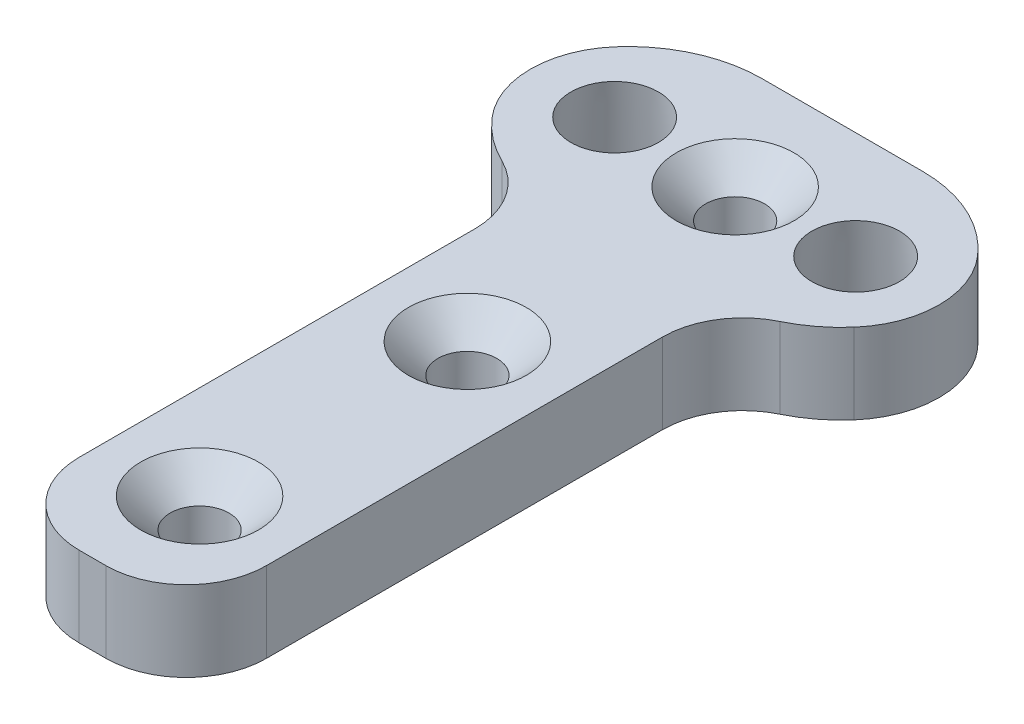
ISO-10303-21;
HEADER;
FILE_DESCRIPTION(('STEP AP214'),'2;1');
FILE_NAME('part.step','',(''),(''),'','','');
FILE_SCHEMA(('AUTOMOTIVE_DESIGN { 1 0 10303 214 1 1 1 1 }'));
ENDSEC;
DATA;
#1=APPLICATION_CONTEXT('core data for automotive mechanical design processes');
#2=APPLICATION_PROTOCOL_DEFINITION('international standard','automotive_design',2000,#1);
#3=PRODUCT_CONTEXT('',#1,'mechanical');
#4=PRODUCT('Part','Part','',(#3));
#5=PRODUCT_RELATED_PRODUCT_CATEGORY('part','',(#4));
#6=PRODUCT_DEFINITION_FORMATION('','',#4);
#7=PRODUCT_DEFINITION_CONTEXT('part definition',#1,'design');
#8=PRODUCT_DEFINITION('design','',#6,#7);
#9=PRODUCT_DEFINITION_SHAPE('','',#8);
#10=(LENGTH_UNIT() NAMED_UNIT(*) SI_UNIT(.MILLI.,.METRE.));
#11=(NAMED_UNIT(*) PLANE_ANGLE_UNIT() SI_UNIT($,.RADIAN.));
#12=(NAMED_UNIT(*) SI_UNIT($,.STERADIAN.) SOLID_ANGLE_UNIT());
#13=UNCERTAINTY_MEASURE_WITH_UNIT(LENGTH_MEASURE(1.E-05),#10,'distance_accuracy_value','');
#14=(GEOMETRIC_REPRESENTATION_CONTEXT(3) GLOBAL_UNCERTAINTY_ASSIGNED_CONTEXT((#13)) GLOBAL_UNIT_ASSIGNED_CONTEXT((#10,
#11,#12)) REPRESENTATION_CONTEXT('',''));
#15=CARTESIAN_POINT('',(0.,0.,0.));
#16=DIRECTION('',(0.,0.,1.));
#17=DIRECTION('',(1.,0.,0.));
#18=AXIS2_PLACEMENT_3D('',#15,#16,#17);
#19=CARTESIAN_POINT('',(0.,3.,0.));
#20=DIRECTION('',(0.,-1.,0.));
#21=DIRECTION('',(0.,0.,-1.));
#22=AXIS2_PLACEMENT_3D('',#19,#20,#21);
#23=PLANE('',#22);
#24=CARTESIAN_POINT('',(-4.5,3.,-10.));
#25=DIRECTION('',(0.,-1.,0.));
#26=DIRECTION('',(0.,0.,-1.));
#27=AXIS2_PLACEMENT_3D('',#24,#25,#26);
#28=CIRCLE('',#27,1.63613285540738);
#29=CARTESIAN_POINT('',(-4.5,3.,-11.6361328554074));
#30=VERTEX_POINT('',#29);
#31=EDGE_CURVE('E445',#30,#30,#28,.T.);
#32=ORIENTED_EDGE('',*,*,#31,.T.);
#33=EDGE_LOOP('',(#32));
#34=FACE_BOUND('',#33,.T.);
#35=CARTESIAN_POINT('',(4.5,3.,-10.));
#36=DIRECTION('',(0.,-1.,0.));
#37=DIRECTION('',(0.,0.,-1.));
#38=AXIS2_PLACEMENT_3D('',#35,#36,#37);
#39=CIRCLE('',#38,1.63613285540738);
#40=CARTESIAN_POINT('',(4.5,3.,-11.6361328554074));
#41=VERTEX_POINT('',#40);
#42=EDGE_CURVE('E37',#41,#41,#39,.T.);
#43=ORIENTED_EDGE('',*,*,#42,.T.);
#44=EDGE_LOOP('',(#43));
#45=FACE_BOUND('',#44,.T.);
#46=CARTESIAN_POINT('',(0.,3.,-10.));
#47=DIRECTION('',(0.,1.,0.));
#48=DIRECTION('',(0.,0.,1.));
#49=AXIS2_PLACEMENT_3D('',#46,#47,#48);
#50=CIRCLE('',#49,2.2);
#51=CARTESIAN_POINT('',(0.,3.,-7.8));
#52=VERTEX_POINT('',#51);
#53=EDGE_CURVE('E439',#52,#52,#50,.T.);
#54=ORIENTED_EDGE('',*,*,#53,.F.);
#55=EDGE_LOOP('',(#54));
#56=FACE_BOUND('',#55,.T.);
#57=CARTESIAN_POINT('',(0.,3.,0.));
#58=DIRECTION('',(0.,1.,0.));
#59=DIRECTION('',(0.,0.,1.));
#60=AXIS2_PLACEMENT_3D('',#57,#58,#59);
#61=CIRCLE('',#60,2.2);
#62=CARTESIAN_POINT('',(0.,3.,2.2));
#63=VERTEX_POINT('',#62);
#64=EDGE_CURVE('E430',#63,#63,#61,.T.);
#65=ORIENTED_EDGE('',*,*,#64,.F.);
#66=EDGE_LOOP('',(#65));
#67=FACE_BOUND('',#66,.T.);
#68=CARTESIAN_POINT('',(0.,3.,10.));
#69=DIRECTION('',(0.,1.,0.));
#70=DIRECTION('',(0.,0.,1.));
#71=AXIS2_PLACEMENT_3D('',#68,#69,#70);
#72=CIRCLE('',#71,2.2);
#73=CARTESIAN_POINT('',(0.,3.,12.2));
#74=VERTEX_POINT('',#73);
#75=EDGE_CURVE('E420',#74,#74,#72,.T.);
#76=ORIENTED_EDGE('',*,*,#75,.F.);
#77=EDGE_LOOP('',(#76));
#78=FACE_BOUND('',#77,.T.);
#79=DIRECTION('',(0.,0.,1.));
#80=VECTOR('',#79,1.);
#81=CARTESIAN_POINT('',(-3.5,3.,-6.));
#82=LINE('',#81,#80);
#83=CARTESIAN_POINT('',(-3.5,3.,-3.78118990056402));
#84=VERTEX_POINT('',#83);
#85=CARTESIAN_POINT('',(-3.5,3.,11.));
#86=VERTEX_POINT('',#85);
#87=EDGE_CURVE('E158',#84,#86,#82,.T.);
#88=ORIENTED_EDGE('',*,*,#87,.T.);
#89=CARTESIAN_POINT('',(-0.499999999999997,3.,11.));
#90=DIRECTION('',(0.,-1.,0.));
#91=DIRECTION('',(0.,0.,-1.));
#92=AXIS2_PLACEMENT_3D('',#89,#90,#91);
#93=CIRCLE('',#92,3.);
#94=CARTESIAN_POINT('',(-0.499999999999997,3.,14.));
#95=VERTEX_POINT('',#94);
#96=EDGE_CURVE('E56',#86,#95,#93,.F.);
#97=ORIENTED_EDGE('',*,*,#96,.T.);
#98=DIRECTION('',(1.,0.,0.));
#99=VECTOR('',#98,1.);
#100=CARTESIAN_POINT('',(-3.5,3.,14.));
#101=LINE('',#100,#99);
#102=CARTESIAN_POINT('',(0.500000000000003,3.,14.));
#103=VERTEX_POINT('',#102);
#104=EDGE_CURVE('E277',#95,#103,#101,.T.);
#105=ORIENTED_EDGE('',*,*,#104,.T.);
#106=CARTESIAN_POINT('',(0.500000000000003,3.,11.));
#107=DIRECTION('',(0.,-1.,0.));
#108=DIRECTION('',(0.,0.,-1.));
#109=AXIS2_PLACEMENT_3D('',#106,#107,#108);
#110=CIRCLE('',#109,3.);
#111=CARTESIAN_POINT('',(3.5,3.,11.));
#112=VERTEX_POINT('',#111);
#113=EDGE_CURVE('E225',#103,#112,#110,.F.);
#114=ORIENTED_EDGE('',*,*,#113,.T.);
#115=DIRECTION('',(0.,0.,-1.));
#116=VECTOR('',#115,1.);
#117=CARTESIAN_POINT('',(3.5,3.,-6.));
#118=LINE('',#117,#116);
#119=CARTESIAN_POINT('',(3.5,3.,-3.78118990056402));
#120=VERTEX_POINT('',#119);
#121=EDGE_CURVE('E168',#112,#120,#118,.T.);
#122=ORIENTED_EDGE('',*,*,#121,.T.);
#123=CARTESIAN_POINT('',(6.5,3.,-3.78118990056402));
#124=DIRECTION('',(0.,-1.,0.));
#125=DIRECTION('',(0.,0.,-1.));
#126=AXIS2_PLACEMENT_3D('',#123,#124,#125);
#127=CIRCLE('',#126,3.);
#128=CARTESIAN_POINT('',(5.1875,3.,-6.47884513242743));
#129=VERTEX_POINT('',#128);
#130=EDGE_CURVE('E11',#120,#129,#127,.T.);
#131=ORIENTED_EDGE('',*,*,#130,.T.);
#132=CARTESIAN_POINT('',(3.,3.,-10.9749371855331));
#133=DIRECTION('',(0.,-1.,0.));
#134=DIRECTION('',(0.,0.,-1.));
#135=AXIS2_PLACEMENT_3D('',#132,#133,#134);
#136=CIRCLE('',#135,5.);
#137=CARTESIAN_POINT('',(6.76372418740866,3.,-7.6833752096446));
#138=VERTEX_POINT('',#137);
#139=EDGE_CURVE('E177',#129,#138,#136,.F.);
#140=ORIENTED_EDGE('',*,*,#139,.T.);
#141=CARTESIAN_POINT('',(4.1291172562226,3.,-9.98746859276655));
#142=DIRECTION('',(0.,-1.,0.));
#143=DIRECTION('',(0.,0.,-1.));
#144=AXIS2_PLACEMENT_3D('',#141,#142,#143);
#145=CIRCLE('',#144,3.5);
#146=CARTESIAN_POINT('',(6.76372418740865,3.,-12.2915619758885));
#147=VERTEX_POINT('',#146);
#148=EDGE_CURVE('E190',#138,#147,#145,.F.);
#149=ORIENTED_EDGE('',*,*,#148,.T.);
#150=CARTESIAN_POINT('',(3.,3.,-9.));
#151=DIRECTION('',(0.,-1.,0.));
#152=DIRECTION('',(0.,0.,-1.));
#153=AXIS2_PLACEMENT_3D('',#150,#151,#152);
#154=CIRCLE('',#153,5.);
#155=CARTESIAN_POINT('',(3.,3.,-14.));
#156=VERTEX_POINT('',#155);
#157=EDGE_CURVE('E175',#147,#156,#154,.F.);
#158=ORIENTED_EDGE('',*,*,#157,.T.);
#159=DIRECTION('',(-1.,0.,0.));
#160=VECTOR('',#159,1.);
#161=CARTESIAN_POINT('',(-8.,3.,-14.));
#162=LINE('',#161,#160);
#163=CARTESIAN_POINT('',(-3.,3.,-14.));
#164=VERTEX_POINT('',#163);
#165=EDGE_CURVE('E143',#156,#164,#162,.T.);
#166=ORIENTED_EDGE('',*,*,#165,.T.);
#167=CARTESIAN_POINT('',(-3.,3.,-9.));
#168=DIRECTION('',(0.,-1.,0.));
#169=DIRECTION('',(0.,0.,-1.));
#170=AXIS2_PLACEMENT_3D('',#167,#168,#169);
#171=CIRCLE('',#170,5.);
#172=CARTESIAN_POINT('',(-6.76372418740866,3.,-12.2915619758885));
#173=VERTEX_POINT('',#172);
#174=EDGE_CURVE('E179',#164,#173,#171,.F.);
#175=ORIENTED_EDGE('',*,*,#174,.T.);
#176=CARTESIAN_POINT('',(-4.1291172562226,3.,-9.98746859276655));
#177=DIRECTION('',(0.,-1.,0.));
#178=DIRECTION('',(0.,0.,-1.));
#179=AXIS2_PLACEMENT_3D('',#176,#177,#178);
#180=CIRCLE('',#179,3.5);
#181=CARTESIAN_POINT('',(-6.76372418740865,3.,-7.68337520964459));
#182=VERTEX_POINT('',#181);
#183=EDGE_CURVE('E188',#173,#182,#180,.F.);
#184=ORIENTED_EDGE('',*,*,#183,.T.);
#185=CARTESIAN_POINT('',(-3.,3.,-10.9749371855331));
#186=DIRECTION('',(0.,-1.,0.));
#187=DIRECTION('',(0.,0.,-1.));
#188=AXIS2_PLACEMENT_3D('',#185,#186,#187);
#189=CIRCLE('',#188,5.);
#190=CARTESIAN_POINT('',(-5.1875,3.,-6.47884513242743));
#191=VERTEX_POINT('',#190);
#192=EDGE_CURVE('E148',#182,#191,#189,.F.);
#193=ORIENTED_EDGE('',*,*,#192,.T.);
#194=CARTESIAN_POINT('',(-6.5,3.,-3.78118990056402));
#195=DIRECTION('',(0.,-1.,0.));
#196=DIRECTION('',(0.,0.,-1.));
#197=AXIS2_PLACEMENT_3D('',#194,#195,#196);
#198=CIRCLE('',#197,3.);
#199=EDGE_CURVE('E230',#191,#84,#198,.T.);
#200=ORIENTED_EDGE('',*,*,#199,.T.);
#201=EDGE_LOOP('',(#88,#97,#105,#114,#122,#131,#140,#149,#158,#166,#175,#184,#193,#200));
#202=FACE_BOUND('',#201,.T.);
#203=ADVANCED_FACE('F33',(#34,#45,#56,#67,#78,#202),#23,.F.);
#204=CARTESIAN_POINT('',(-3.5,3.,-6.));
#205=DIRECTION('',(1.,0.,0.));
#206=DIRECTION('',(0.,0.,-1.));
#207=AXIS2_PLACEMENT_3D('',#204,#205,#206);
#208=PLANE('',#207);
#209=ORIENTED_EDGE('',*,*,#87,.F.);
#210=DIRECTION('',(0.,-1.,0.));
#211=VECTOR('',#210,1.);
#212=CARTESIAN_POINT('',(-3.5,3.,-3.78118990056402));
#213=LINE('',#212,#211);
#214=CARTESIAN_POINT('',(-3.5,0.,-3.78118990056402));
#215=VERTEX_POINT('',#214);
#216=EDGE_CURVE('E204',#84,#215,#213,.T.);
#217=ORIENTED_EDGE('',*,*,#216,.T.);
#218=DIRECTION('',(0.,0.,1.));
#219=VECTOR('',#218,1.);
#220=CARTESIAN_POINT('',(-3.5,0.,-6.));
#221=LINE('',#220,#219);
#222=CARTESIAN_POINT('',(-3.5,0.,11.));
#223=VERTEX_POINT('',#222);
#224=EDGE_CURVE('E285',#215,#223,#221,.T.);
#225=ORIENTED_EDGE('',*,*,#224,.T.);
#226=DIRECTION('',(0.,-1.,0.));
#227=VECTOR('',#226,1.);
#228=CARTESIAN_POINT('',(-3.5,3.,11.));
#229=LINE('',#228,#227);
#230=EDGE_CURVE('E202',#223,#86,#229,.F.);
#231=ORIENTED_EDGE('',*,*,#230,.T.);
#232=EDGE_LOOP('',(#209,#217,#225,#231));
#233=FACE_BOUND('',#232,.T.);
#234=ADVANCED_FACE('F273',(#233),#208,.F.);
#235=CARTESIAN_POINT('',(-3.5,3.,14.));
#236=DIRECTION('',(0.,0.,-1.));
#237=DIRECTION('',(-1.,0.,0.));
#238=AXIS2_PLACEMENT_3D('',#235,#236,#237);
#239=PLANE('',#238);
#240=ORIENTED_EDGE('',*,*,#104,.F.);
#241=DIRECTION('',(0.,-1.,0.));
#242=VECTOR('',#241,1.);
#243=CARTESIAN_POINT('',(-0.499999999999997,3.,14.));
#244=LINE('',#243,#242);
#245=CARTESIAN_POINT('',(-0.499999999999997,0.,14.));
#246=VERTEX_POINT('',#245);
#247=EDGE_CURVE('E218',#95,#246,#244,.T.);
#248=ORIENTED_EDGE('',*,*,#247,.T.);
#249=DIRECTION('',(1.,0.,0.));
#250=VECTOR('',#249,1.);
#251=CARTESIAN_POINT('',(-3.5,0.,14.));
#252=LINE('',#251,#250);
#253=CARTESIAN_POINT('',(0.500000000000003,0.,14.));
#254=VERTEX_POINT('',#253);
#255=EDGE_CURVE('E243',#246,#254,#252,.T.);
#256=ORIENTED_EDGE('',*,*,#255,.T.);
#257=DIRECTION('',(0.,-1.,0.));
#258=VECTOR('',#257,1.);
#259=CARTESIAN_POINT('',(0.500000000000003,3.,14.));
#260=LINE('',#259,#258);
#261=EDGE_CURVE('E49',#254,#103,#260,.F.);
#262=ORIENTED_EDGE('',*,*,#261,.T.);
#263=EDGE_LOOP('',(#240,#248,#256,#262));
#264=FACE_BOUND('',#263,.T.);
#265=ADVANCED_FACE('F287',(#264),#239,.F.);
#266=CARTESIAN_POINT('',(3.5,3.,-6.));
#267=DIRECTION('',(-1.,0.,0.));
#268=DIRECTION('',(0.,0.,1.));
#269=AXIS2_PLACEMENT_3D('',#266,#267,#268);
#270=PLANE('',#269);
#271=DIRECTION('',(0.,0.,-1.));
#272=VECTOR('',#271,1.);
#273=CARTESIAN_POINT('',(3.5,0.,-6.));
#274=LINE('',#273,#272);
#275=CARTESIAN_POINT('',(3.5,0.,11.));
#276=VERTEX_POINT('',#275);
#277=CARTESIAN_POINT('',(3.5,0.,-3.78118990056402));
#278=VERTEX_POINT('',#277);
#279=EDGE_CURVE('E159',#276,#278,#274,.T.);
#280=ORIENTED_EDGE('',*,*,#279,.T.);
#281=DIRECTION('',(0.,1.,0.));
#282=VECTOR('',#281,1.);
#283=CARTESIAN_POINT('',(3.5,3.,-3.78118990056402));
#284=LINE('',#283,#282);
#285=EDGE_CURVE('E215',#278,#120,#284,.T.);
#286=ORIENTED_EDGE('',*,*,#285,.T.);
#287=ORIENTED_EDGE('',*,*,#121,.F.);
#288=DIRECTION('',(0.,-1.,0.));
#289=VECTOR('',#288,1.);
#290=CARTESIAN_POINT('',(3.5,3.,11.));
#291=LINE('',#290,#289);
#292=EDGE_CURVE('E212',#112,#276,#291,.T.);
#293=ORIENTED_EDGE('',*,*,#292,.T.);
#294=EDGE_LOOP('',(#280,#286,#287,#293));
#295=FACE_BOUND('',#294,.T.);
#296=ADVANCED_FACE('F239',(#295),#270,.F.);
#297=CARTESIAN_POINT('',(-8.,3.,-14.));
#298=DIRECTION('',(0.,0.,1.));
#299=DIRECTION('',(1.,0.,0.));
#300=AXIS2_PLACEMENT_3D('',#297,#298,#299);
#301=PLANE('',#300);
#302=DIRECTION('',(-1.,0.,0.));
#303=VECTOR('',#302,1.);
#304=CARTESIAN_POINT('',(-8.,0.,-14.));
#305=LINE('',#304,#303);
#306=CARTESIAN_POINT('',(3.,0.,-14.));
#307=VERTEX_POINT('',#306);
#308=CARTESIAN_POINT('',(-3.,0.,-14.));
#309=VERTEX_POINT('',#308);
#310=EDGE_CURVE('E140',#307,#309,#305,.T.);
#311=ORIENTED_EDGE('',*,*,#310,.T.);
#312=DIRECTION('',(0.,-1.,0.));
#313=VECTOR('',#312,1.);
#314=CARTESIAN_POINT('',(-3.,3.,-14.));
#315=LINE('',#314,#313);
#316=EDGE_CURVE('E147',#309,#164,#315,.F.);
#317=ORIENTED_EDGE('',*,*,#316,.T.);
#318=ORIENTED_EDGE('',*,*,#165,.F.);
#319=DIRECTION('',(0.,-1.,0.));
#320=VECTOR('',#319,1.);
#321=CARTESIAN_POINT('',(3.,3.,-14.));
#322=LINE('',#321,#320);
#323=EDGE_CURVE('E137',#156,#307,#322,.T.);
#324=ORIENTED_EDGE('',*,*,#323,.T.);
#325=EDGE_LOOP('',(#311,#317,#318,#324));
#326=FACE_BOUND('',#325,.T.);
#327=ADVANCED_FACE('F139',(#326),#301,.F.);
#328=CARTESIAN_POINT('',(0.,0.,0.));
#329=DIRECTION('',(0.,-1.,0.));
#330=DIRECTION('',(0.,0.,-1.));
#331=AXIS2_PLACEMENT_3D('',#328,#329,#330);
#332=PLANE('',#331);
#333=CARTESIAN_POINT('',(-4.5,0.,-10.));
#334=DIRECTION('',(0.,-1.,0.));
#335=DIRECTION('',(0.,0.,-1.));
#336=AXIS2_PLACEMENT_3D('',#333,#334,#335);
#337=CIRCLE('',#336,1.925);
#338=CARTESIAN_POINT('',(-4.5,0.,-11.925));
#339=VERTEX_POINT('',#338);
#340=EDGE_CURVE('E447',#339,#339,#337,.T.);
#341=ORIENTED_EDGE('',*,*,#340,.F.);
#342=EDGE_LOOP('',(#341));
#343=FACE_BOUND('',#342,.T.);
#344=CARTESIAN_POINT('',(4.5,0.,-10.));
#345=DIRECTION('',(0.,-1.,0.));
#346=DIRECTION('',(0.,0.,-1.));
#347=AXIS2_PLACEMENT_3D('',#344,#345,#346);
#348=CIRCLE('',#347,1.925);
#349=CARTESIAN_POINT('',(4.5,0.,-11.925));
#350=VERTEX_POINT('',#349);
#351=EDGE_CURVE('E442',#350,#350,#348,.T.);
#352=ORIENTED_EDGE('',*,*,#351,.F.);
#353=EDGE_LOOP('',(#352));
#354=FACE_BOUND('',#353,.T.);
#355=CARTESIAN_POINT('',(0.,0.,-10.));
#356=DIRECTION('',(0.,1.,0.));
#357=DIRECTION('',(0.,0.,1.));
#358=AXIS2_PLACEMENT_3D('',#355,#356,#357);
#359=CIRCLE('',#358,1.1);
#360=CARTESIAN_POINT('',(0.,0.,-8.9));
#361=VERTEX_POINT('',#360);
#362=EDGE_CURVE('E433',#361,#361,#359,.T.);
#363=ORIENTED_EDGE('',*,*,#362,.T.);
#364=EDGE_LOOP('',(#363));
#365=FACE_BOUND('',#364,.T.);
#366=CARTESIAN_POINT('',(0.,0.,0.));
#367=DIRECTION('',(0.,1.,0.));
#368=DIRECTION('',(0.,0.,1.));
#369=AXIS2_PLACEMENT_3D('',#366,#367,#368);
#370=CIRCLE('',#369,1.1);
#371=CARTESIAN_POINT('',(0.,0.,1.1));
#372=VERTEX_POINT('',#371);
#373=EDGE_CURVE('E422',#372,#372,#370,.T.);
#374=ORIENTED_EDGE('',*,*,#373,.T.);
#375=EDGE_LOOP('',(#374));
#376=FACE_BOUND('',#375,.T.);
#377=CARTESIAN_POINT('',(0.,0.,10.));
#378=DIRECTION('',(0.,1.,0.));
#379=DIRECTION('',(0.,0.,1.));
#380=AXIS2_PLACEMENT_3D('',#377,#378,#379);
#381=CIRCLE('',#380,1.1);
#382=CARTESIAN_POINT('',(0.,0.,11.1));
#383=VERTEX_POINT('',#382);
#384=EDGE_CURVE('E281',#383,#383,#381,.T.);
#385=ORIENTED_EDGE('',*,*,#384,.T.);
#386=EDGE_LOOP('',(#385));
#387=FACE_BOUND('',#386,.T.);
#388=ORIENTED_EDGE('',*,*,#255,.F.);
#389=CARTESIAN_POINT('',(-0.499999999999997,0.,11.));
#390=DIRECTION('',(0.,-1.,0.));
#391=DIRECTION('',(0.,0.,-1.));
#392=AXIS2_PLACEMENT_3D('',#389,#390,#391);
#393=CIRCLE('',#392,3.);
#394=EDGE_CURVE('E223',#246,#223,#393,.T.);
#395=ORIENTED_EDGE('',*,*,#394,.T.);
#396=ORIENTED_EDGE('',*,*,#224,.F.);
#397=CARTESIAN_POINT('',(-6.5,0.,-3.78118990056402));
#398=DIRECTION('',(0.,-1.,0.));
#399=DIRECTION('',(0.,0.,-1.));
#400=AXIS2_PLACEMENT_3D('',#397,#398,#399);
#401=CIRCLE('',#400,3.);
#402=CARTESIAN_POINT('',(-5.1875,0.,-6.47884513242743));
#403=VERTEX_POINT('',#402);
#404=EDGE_CURVE('E228',#215,#403,#401,.F.);
#405=ORIENTED_EDGE('',*,*,#404,.T.);
#406=CARTESIAN_POINT('',(-3.,0.,-10.9749371855331));
#407=DIRECTION('',(0.,-1.,0.));
#408=DIRECTION('',(0.,0.,-1.));
#409=AXIS2_PLACEMENT_3D('',#406,#407,#408);
#410=CIRCLE('',#409,5.);
#411=CARTESIAN_POINT('',(-6.76372418740865,0.,-7.68337520964459));
#412=VERTEX_POINT('',#411);
#413=EDGE_CURVE('E173',#403,#412,#410,.T.);
#414=ORIENTED_EDGE('',*,*,#413,.T.);
#415=CARTESIAN_POINT('',(-4.1291172562226,0.,-9.98746859276655));
#416=DIRECTION('',(0.,-1.,0.));
#417=DIRECTION('',(0.,0.,-1.));
#418=AXIS2_PLACEMENT_3D('',#415,#416,#417);
#419=CIRCLE('',#418,3.5);
#420=CARTESIAN_POINT('',(-6.76372418740866,0.,-12.2915619758885));
#421=VERTEX_POINT('',#420);
#422=EDGE_CURVE('E193',#412,#421,#419,.T.);
#423=ORIENTED_EDGE('',*,*,#422,.T.);
#424=CARTESIAN_POINT('',(-3.,0.,-9.));
#425=DIRECTION('',(0.,-1.,0.));
#426=DIRECTION('',(0.,0.,-1.));
#427=AXIS2_PLACEMENT_3D('',#424,#425,#426);
#428=CIRCLE('',#427,5.);
#429=EDGE_CURVE('E157',#421,#309,#428,.T.);
#430=ORIENTED_EDGE('',*,*,#429,.T.);
#431=ORIENTED_EDGE('',*,*,#310,.F.);
#432=CARTESIAN_POINT('',(3.,0.,-9.));
#433=DIRECTION('',(0.,-1.,0.));
#434=DIRECTION('',(0.,0.,-1.));
#435=AXIS2_PLACEMENT_3D('',#432,#433,#434);
#436=CIRCLE('',#435,5.);
#437=CARTESIAN_POINT('',(6.76372418740865,0.,-12.2915619758885));
#438=VERTEX_POINT('',#437);
#439=EDGE_CURVE('E154',#307,#438,#436,.T.);
#440=ORIENTED_EDGE('',*,*,#439,.T.);
#441=CARTESIAN_POINT('',(4.1291172562226,0.,-9.98746859276655));
#442=DIRECTION('',(0.,-1.,0.));
#443=DIRECTION('',(0.,0.,-1.));
#444=AXIS2_PLACEMENT_3D('',#441,#442,#443);
#445=CIRCLE('',#444,3.5);
#446=CARTESIAN_POINT('',(6.76372418740866,0.,-7.6833752096446));
#447=VERTEX_POINT('',#446);
#448=EDGE_CURVE('E195',#438,#447,#445,.T.);
#449=ORIENTED_EDGE('',*,*,#448,.T.);
#450=CARTESIAN_POINT('',(3.,0.,-10.9749371855331));
#451=DIRECTION('',(0.,-1.,0.));
#452=DIRECTION('',(0.,0.,-1.));
#453=AXIS2_PLACEMENT_3D('',#450,#451,#452);
#454=CIRCLE('',#453,5.);
#455=CARTESIAN_POINT('',(5.1875,0.,-6.47884513242743));
#456=VERTEX_POINT('',#455);
#457=EDGE_CURVE('E164',#447,#456,#454,.T.);
#458=ORIENTED_EDGE('',*,*,#457,.T.);
#459=CARTESIAN_POINT('',(6.5,0.,-3.78118990056402));
#460=DIRECTION('',(0.,-1.,0.));
#461=DIRECTION('',(0.,0.,-1.));
#462=AXIS2_PLACEMENT_3D('',#459,#460,#461);
#463=CIRCLE('',#462,3.);
#464=EDGE_CURVE('E42',#456,#278,#463,.F.);
#465=ORIENTED_EDGE('',*,*,#464,.T.);
#466=ORIENTED_EDGE('',*,*,#279,.F.);
#467=CARTESIAN_POINT('',(0.500000000000003,0.,11.));
#468=DIRECTION('',(0.,-1.,0.));
#469=DIRECTION('',(0.,0.,-1.));
#470=AXIS2_PLACEMENT_3D('',#467,#468,#469);
#471=CIRCLE('',#470,3.);
#472=EDGE_CURVE('E221',#276,#254,#471,.T.);
#473=ORIENTED_EDGE('',*,*,#472,.T.);
#474=EDGE_LOOP('',(#388,#395,#396,#405,#414,#423,#430,#431,#440,#449,#458,#465,#466,#473));
#475=FACE_BOUND('',#474,.T.);
#476=ADVANCED_FACE('F153',(#343,#354,#365,#376,#387,#475),#332,.T.);
#477=CARTESIAN_POINT('',(0.,3.,10.));
#478=DIRECTION('',(0.,1.,0.));
#479=DIRECTION('',(0.,0.,1.));
#480=AXIS2_PLACEMENT_3D('',#477,#478,#479);
#481=CYLINDRICAL_SURFACE('',#480,1.1);
#482=ORIENTED_EDGE('',*,*,#384,.F.);
#483=EDGE_LOOP('',(#482));
#484=FACE_BOUND('',#483,.T.);
#485=CARTESIAN_POINT('',(0.,1.9,10.));
#486=DIRECTION('',(0.,1.,0.));
#487=DIRECTION('',(0.,0.,1.));
#488=AXIS2_PLACEMENT_3D('',#485,#486,#487);
#489=CIRCLE('',#488,1.1);
#490=CARTESIAN_POINT('',(0.,1.9,11.1));
#491=VERTEX_POINT('',#490);
#492=EDGE_CURVE('E417',#491,#491,#489,.T.);
#493=ORIENTED_EDGE('',*,*,#492,.T.);
#494=EDGE_LOOP('',(#493));
#495=FACE_BOUND('',#494,.T.);
#496=ADVANCED_FACE('F311',(#484,#495),#481,.F.);
#497=CARTESIAN_POINT('',(0.,3.,10.));
#498=DIRECTION('',(0.,1.,0.));
#499=DIRECTION('',(0.,0.,1.));
#500=AXIS2_PLACEMENT_3D('',#497,#498,#499);
#501=CONICAL_SURFACE('',#500,2.2,0.785398163397447);
#502=ORIENTED_EDGE('',*,*,#492,.F.);
#503=EDGE_LOOP('',(#502));
#504=FACE_BOUND('',#503,.T.);
#505=ORIENTED_EDGE('',*,*,#75,.T.);
#506=EDGE_LOOP('',(#505));
#507=FACE_BOUND('',#506,.T.);
#508=ADVANCED_FACE('F407',(#504,#507),#501,.F.);
#509=CARTESIAN_POINT('',(0.,3.,0.));
#510=DIRECTION('',(0.,1.,0.));
#511=DIRECTION('',(0.,0.,1.));
#512=AXIS2_PLACEMENT_3D('',#509,#510,#511);
#513=CYLINDRICAL_SURFACE('',#512,1.1);
#514=ORIENTED_EDGE('',*,*,#373,.F.);
#515=EDGE_LOOP('',(#514));
#516=FACE_BOUND('',#515,.T.);
#517=CARTESIAN_POINT('',(0.,1.9,0.));
#518=DIRECTION('',(0.,1.,0.));
#519=DIRECTION('',(0.,0.,1.));
#520=AXIS2_PLACEMENT_3D('',#517,#518,#519);
#521=CIRCLE('',#520,1.1);
#522=CARTESIAN_POINT('',(0.,1.9,1.1));
#523=VERTEX_POINT('',#522);
#524=EDGE_CURVE('E425',#523,#523,#521,.T.);
#525=ORIENTED_EDGE('',*,*,#524,.T.);
#526=EDGE_LOOP('',(#525));
#527=FACE_BOUND('',#526,.T.);
#528=ADVANCED_FACE('F404',(#516,#527),#513,.F.);
#529=CARTESIAN_POINT('',(0.,3.,0.));
#530=DIRECTION('',(0.,1.,0.));
#531=DIRECTION('',(0.,0.,1.));
#532=AXIS2_PLACEMENT_3D('',#529,#530,#531);
#533=CONICAL_SURFACE('',#532,2.2,0.785398163397447);
#534=ORIENTED_EDGE('',*,*,#524,.F.);
#535=EDGE_LOOP('',(#534));
#536=FACE_BOUND('',#535,.T.);
#537=ORIENTED_EDGE('',*,*,#64,.T.);
#538=EDGE_LOOP('',(#537));
#539=FACE_BOUND('',#538,.T.);
#540=ADVANCED_FACE('F400',(#536,#539),#533,.F.);
#541=CARTESIAN_POINT('',(0.,3.,-10.));
#542=DIRECTION('',(0.,1.,0.));
#543=DIRECTION('',(0.,0.,1.));
#544=AXIS2_PLACEMENT_3D('',#541,#542,#543);
#545=CYLINDRICAL_SURFACE('',#544,1.1);
#546=ORIENTED_EDGE('',*,*,#362,.F.);
#547=EDGE_LOOP('',(#546));
#548=FACE_BOUND('',#547,.T.);
#549=CARTESIAN_POINT('',(0.,1.9,-10.));
#550=DIRECTION('',(0.,1.,0.));
#551=DIRECTION('',(0.,0.,1.));
#552=AXIS2_PLACEMENT_3D('',#549,#550,#551);
#553=CIRCLE('',#552,1.1);
#554=CARTESIAN_POINT('',(0.,1.9,-8.9));
#555=VERTEX_POINT('',#554);
#556=EDGE_CURVE('E436',#555,#555,#553,.T.);
#557=ORIENTED_EDGE('',*,*,#556,.T.);
#558=EDGE_LOOP('',(#557));
#559=FACE_BOUND('',#558,.T.);
#560=ADVANCED_FACE('F396',(#548,#559),#545,.F.);
#561=CARTESIAN_POINT('',(0.,3.,-10.));
#562=DIRECTION('',(0.,1.,0.));
#563=DIRECTION('',(0.,0.,1.));
#564=AXIS2_PLACEMENT_3D('',#561,#562,#563);
#565=CONICAL_SURFACE('',#564,2.2,0.785398163397447);
#566=ORIENTED_EDGE('',*,*,#556,.F.);
#567=EDGE_LOOP('',(#566));
#568=FACE_BOUND('',#567,.T.);
#569=ORIENTED_EDGE('',*,*,#53,.T.);
#570=EDGE_LOOP('',(#569));
#571=FACE_BOUND('',#570,.T.);
#572=ADVANCED_FACE('F326',(#568,#571),#565,.F.);
#573=CARTESIAN_POINT('',(-3.,3.,-9.));
#574=DIRECTION('',(0.,-1.,0.));
#575=DIRECTION('',(0.,0.,-1.));
#576=AXIS2_PLACEMENT_3D('',#573,#574,#575);
#577=CYLINDRICAL_SURFACE('',#576,5.);
#578=ORIENTED_EDGE('',*,*,#429,.F.);
#579=DIRECTION('',(0.,-1.,0.));
#580=VECTOR('',#579,1.);
#581=CARTESIAN_POINT('',(-6.76372418740866,3.,-12.2915619758885));
#582=LINE('',#581,#580);
#583=EDGE_CURVE('E200',#421,#173,#582,.F.);
#584=ORIENTED_EDGE('',*,*,#583,.T.);
#585=ORIENTED_EDGE('',*,*,#174,.F.);
#586=ORIENTED_EDGE('',*,*,#316,.F.);
#587=EDGE_LOOP('',(#578,#584,#585,#586));
#588=FACE_BOUND('',#587,.T.);
#589=ADVANCED_FACE('F256',(#588),#577,.T.);
#590=CARTESIAN_POINT('',(-3.,3.,-10.9749371855331));
#591=DIRECTION('',(0.,-1.,0.));
#592=DIRECTION('',(0.,0.,-1.));
#593=AXIS2_PLACEMENT_3D('',#590,#591,#592);
#594=CYLINDRICAL_SURFACE('',#593,5.);
#595=ORIENTED_EDGE('',*,*,#413,.F.);
#596=DIRECTION('',(0.,-1.,0.));
#597=VECTOR('',#596,1.);
#598=CARTESIAN_POINT('',(-5.1875,3.,-6.47884513242743));
#599=LINE('',#598,#597);
#600=EDGE_CURVE('E207',#403,#191,#599,.F.);
#601=ORIENTED_EDGE('',*,*,#600,.T.);
#602=ORIENTED_EDGE('',*,*,#192,.F.);
#603=DIRECTION('',(0.,-1.,0.));
#604=VECTOR('',#603,1.);
#605=CARTESIAN_POINT('',(-6.76372418740865,3.,-7.68337520964459));
#606=LINE('',#605,#604);
#607=EDGE_CURVE('E197',#182,#412,#606,.T.);
#608=ORIENTED_EDGE('',*,*,#607,.T.);
#609=EDGE_LOOP('',(#595,#601,#602,#608));
#610=FACE_BOUND('',#609,.T.);
#611=ADVANCED_FACE('F266',(#610),#594,.T.);
#612=CARTESIAN_POINT('',(3.,3.,-9.));
#613=DIRECTION('',(0.,-1.,0.));
#614=DIRECTION('',(0.,0.,-1.));
#615=AXIS2_PLACEMENT_3D('',#612,#613,#614);
#616=CYLINDRICAL_SURFACE('',#615,5.);
#617=ORIENTED_EDGE('',*,*,#157,.F.);
#618=DIRECTION('',(0.,-1.,0.));
#619=VECTOR('',#618,1.);
#620=CARTESIAN_POINT('',(6.76372418740865,3.,-12.2915619758885));
#621=LINE('',#620,#619);
#622=EDGE_CURVE('E163',#147,#438,#621,.T.);
#623=ORIENTED_EDGE('',*,*,#622,.T.);
#624=ORIENTED_EDGE('',*,*,#439,.F.);
#625=ORIENTED_EDGE('',*,*,#323,.F.);
#626=EDGE_LOOP('',(#617,#623,#624,#625));
#627=FACE_BOUND('',#626,.T.);
#628=ADVANCED_FACE('F161',(#627),#616,.T.);
#629=CARTESIAN_POINT('',(3.,3.,-10.9749371855331));
#630=DIRECTION('',(0.,1.,0.));
#631=DIRECTION('',(0.,0.,1.));
#632=AXIS2_PLACEMENT_3D('',#629,#630,#631);
#633=CYLINDRICAL_SURFACE('',#632,5.);
#634=ORIENTED_EDGE('',*,*,#139,.F.);
#635=DIRECTION('',(0.,1.,0.));
#636=VECTOR('',#635,1.);
#637=CARTESIAN_POINT('',(5.1875,3.,-6.47884513242743));
#638=LINE('',#637,#636);
#639=EDGE_CURVE('E209',#129,#456,#638,.F.);
#640=ORIENTED_EDGE('',*,*,#639,.T.);
#641=ORIENTED_EDGE('',*,*,#457,.F.);
#642=DIRECTION('',(0.,1.,0.));
#643=VECTOR('',#642,1.);
#644=CARTESIAN_POINT('',(6.76372418740866,3.,-7.6833752096446));
#645=LINE('',#644,#643);
#646=EDGE_CURVE('E185',#447,#138,#645,.T.);
#647=ORIENTED_EDGE('',*,*,#646,.T.);
#648=EDGE_LOOP('',(#634,#640,#641,#647));
#649=FACE_BOUND('',#648,.T.);
#650=ADVANCED_FACE('F249',(#649),#633,.T.);
#651=CARTESIAN_POINT('',(4.1291172562226,3.,-9.98746859276655));
#652=DIRECTION('',(0.,1.,0.));
#653=DIRECTION('',(0.,0.,1.));
#654=AXIS2_PLACEMENT_3D('',#651,#652,#653);
#655=CYLINDRICAL_SURFACE('',#654,3.5);
#656=ORIENTED_EDGE('',*,*,#448,.F.);
#657=ORIENTED_EDGE('',*,*,#622,.F.);
#658=ORIENTED_EDGE('',*,*,#148,.F.);
#659=ORIENTED_EDGE('',*,*,#646,.F.);
#660=EDGE_LOOP('',(#656,#657,#658,#659));
#661=FACE_BOUND('',#660,.T.);
#662=ADVANCED_FACE('F252',(#661),#655,.T.);
#663=CARTESIAN_POINT('',(-4.1291172562226,3.,-9.98746859276655));
#664=DIRECTION('',(0.,-1.,0.));
#665=DIRECTION('',(0.,0.,-1.));
#666=AXIS2_PLACEMENT_3D('',#663,#664,#665);
#667=CYLINDRICAL_SURFACE('',#666,3.5);
#668=ORIENTED_EDGE('',*,*,#183,.F.);
#669=ORIENTED_EDGE('',*,*,#583,.F.);
#670=ORIENTED_EDGE('',*,*,#422,.F.);
#671=ORIENTED_EDGE('',*,*,#607,.F.);
#672=EDGE_LOOP('',(#668,#669,#670,#671));
#673=FACE_BOUND('',#672,.T.);
#674=ADVANCED_FACE('F260',(#673),#667,.T.);
#675=CARTESIAN_POINT('',(-6.5,3.,-3.78118990056402));
#676=DIRECTION('',(0.,-1.,0.));
#677=DIRECTION('',(0.,0.,-1.));
#678=AXIS2_PLACEMENT_3D('',#675,#676,#677);
#679=CYLINDRICAL_SURFACE('',#678,3.);
#680=ORIENTED_EDGE('',*,*,#199,.F.);
#681=ORIENTED_EDGE('',*,*,#600,.F.);
#682=ORIENTED_EDGE('',*,*,#404,.F.);
#683=ORIENTED_EDGE('',*,*,#216,.F.);
#684=EDGE_LOOP('',(#680,#681,#682,#683));
#685=FACE_BOUND('',#684,.T.);
#686=ADVANCED_FACE('F269',(#685),#679,.F.);
#687=CARTESIAN_POINT('',(6.5,3.,-3.78118990056402));
#688=DIRECTION('',(0.,1.,0.));
#689=DIRECTION('',(0.,0.,1.));
#690=AXIS2_PLACEMENT_3D('',#687,#688,#689);
#691=CYLINDRICAL_SURFACE('',#690,3.);
#692=ORIENTED_EDGE('',*,*,#130,.F.);
#693=ORIENTED_EDGE('',*,*,#285,.F.);
#694=ORIENTED_EDGE('',*,*,#464,.F.);
#695=ORIENTED_EDGE('',*,*,#639,.F.);
#696=EDGE_LOOP('',(#692,#693,#694,#695));
#697=FACE_BOUND('',#696,.T.);
#698=ADVANCED_FACE('F245',(#697),#691,.F.);
#699=CARTESIAN_POINT('',(-0.499999999999997,3.,11.));
#700=DIRECTION('',(0.,-1.,0.));
#701=DIRECTION('',(0.,0.,-1.));
#702=AXIS2_PLACEMENT_3D('',#699,#700,#701);
#703=CYLINDRICAL_SURFACE('',#702,3.);
#704=ORIENTED_EDGE('',*,*,#96,.F.);
#705=ORIENTED_EDGE('',*,*,#230,.F.);
#706=ORIENTED_EDGE('',*,*,#394,.F.);
#707=ORIENTED_EDGE('',*,*,#247,.F.);
#708=EDGE_LOOP('',(#704,#705,#706,#707));
#709=FACE_BOUND('',#708,.T.);
#710=ADVANCED_FACE('F292',(#709),#703,.T.);
#711=CARTESIAN_POINT('',(0.500000000000003,3.,11.));
#712=DIRECTION('',(0.,-1.,0.));
#713=DIRECTION('',(0.,0.,-1.));
#714=AXIS2_PLACEMENT_3D('',#711,#712,#713);
#715=CYLINDRICAL_SURFACE('',#714,3.);
#716=ORIENTED_EDGE('',*,*,#113,.F.);
#717=ORIENTED_EDGE('',*,*,#261,.F.);
#718=ORIENTED_EDGE('',*,*,#472,.F.);
#719=ORIENTED_EDGE('',*,*,#292,.F.);
#720=EDGE_LOOP('',(#716,#717,#718,#719));
#721=FACE_BOUND('',#720,.T.);
#722=ADVANCED_FACE('F35',(#721),#715,.T.);
#723=CARTESIAN_POINT('',(4.5,0.,-10.));
#724=DIRECTION('',(0.,-1.,0.));
#725=DIRECTION('',(0.,0.,-1.));
#726=AXIS2_PLACEMENT_3D('',#723,#724,#725);
#727=CONICAL_SURFACE('',#726,1.925,0.0959931088596877);
#728=ORIENTED_EDGE('',*,*,#351,.T.);
#729=EDGE_LOOP('',(#728));
#730=FACE_BOUND('',#729,.T.);
#731=ORIENTED_EDGE('',*,*,#42,.F.);
#732=EDGE_LOOP('',(#731));
#733=FACE_BOUND('',#732,.T.);
#734=ADVANCED_FACE('F298',(#730,#733),#727,.F.);
#735=CARTESIAN_POINT('',(-4.5,0.,-10.));
#736=DIRECTION('',(0.,-1.,0.));
#737=DIRECTION('',(0.,0.,-1.));
#738=AXIS2_PLACEMENT_3D('',#735,#736,#737);
#739=CONICAL_SURFACE('',#738,1.925,0.0959931088596879);
#740=ORIENTED_EDGE('',*,*,#340,.T.);
#741=EDGE_LOOP('',(#740));
#742=FACE_BOUND('',#741,.T.);
#743=ORIENTED_EDGE('',*,*,#31,.F.);
#744=EDGE_LOOP('',(#743));
#745=FACE_BOUND('',#744,.T.);
#746=ADVANCED_FACE('F377',(#742,#745),#739,.F.);
#747=CLOSED_SHELL('',(#203,#234,#265,#296,#327,#476,#496,#508,#528,#540,#560,#572,#589,#611,
#628,#650,#662,#674,#686,#698,#710,#722,#734,#746));
#748=MANIFOLD_SOLID_BREP('B2',#747);
#749=ADVANCED_BREP_SHAPE_REPRESENTATION('',(#18,#748),#14);
#750=SHAPE_DEFINITION_REPRESENTATION(#9,#749);
ENDSEC;
END-ISO-10303-21;
